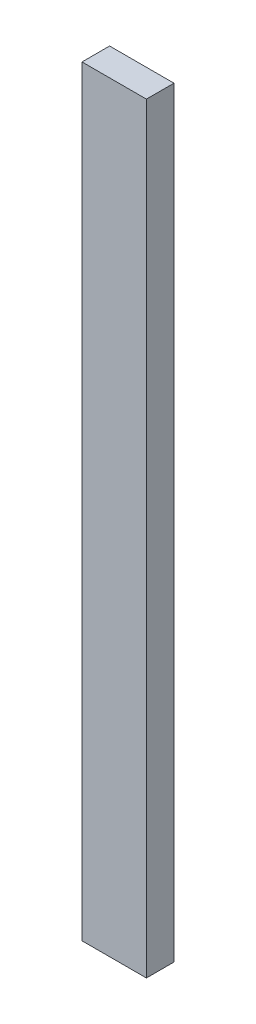
ISO-10303-21;
HEADER;
FILE_DESCRIPTION(('STEP AP214'),'2;1');
FILE_NAME('part.step','',(''),(''),'','','');
FILE_SCHEMA(('AUTOMOTIVE_DESIGN { 1 0 10303 214 1 1 1 1 }'));
ENDSEC;
DATA;
#1=APPLICATION_CONTEXT('core data for automotive mechanical design processes');
#2=APPLICATION_PROTOCOL_DEFINITION('international standard','automotive_design',2000,#1);
#3=PRODUCT_CONTEXT('',#1,'mechanical');
#4=PRODUCT('Part','Part','',(#3));
#5=PRODUCT_RELATED_PRODUCT_CATEGORY('part','',(#4));
#6=PRODUCT_DEFINITION_FORMATION('','',#4);
#7=PRODUCT_DEFINITION_CONTEXT('part definition',#1,'design');
#8=PRODUCT_DEFINITION('design','',#6,#7);
#9=PRODUCT_DEFINITION_SHAPE('','',#8);
#10=(LENGTH_UNIT() NAMED_UNIT(*) SI_UNIT(.MILLI.,.METRE.));
#11=(NAMED_UNIT(*) PLANE_ANGLE_UNIT() SI_UNIT($,.RADIAN.));
#12=(NAMED_UNIT(*) SI_UNIT($,.STERADIAN.) SOLID_ANGLE_UNIT());
#13=UNCERTAINTY_MEASURE_WITH_UNIT(LENGTH_MEASURE(1.E-05),#10,'distance_accuracy_value','');
#14=(GEOMETRIC_REPRESENTATION_CONTEXT(3) GLOBAL_UNCERTAINTY_ASSIGNED_CONTEXT((#13)) GLOBAL_UNIT_ASSIGNED_CONTEXT((#10,
#11,#12)) REPRESENTATION_CONTEXT('',''));
#15=CARTESIAN_POINT('',(0.,0.,0.));
#16=DIRECTION('',(0.,0.,1.));
#17=DIRECTION('',(1.,0.,0.));
#18=AXIS2_PLACEMENT_3D('',#15,#16,#17);
#19=CARTESIAN_POINT('',(-44.45,1050.925,19.05));
#20=DIRECTION('',(-1.,0.,0.));
#21=DIRECTION('',(0.,0.,1.));
#22=AXIS2_PLACEMENT_3D('',#19,#20,#21);
#23=PLANE('',#22);
#24=DIRECTION('',(0.,0.,-1.));
#25=VECTOR('',#24,1.);
#26=CARTESIAN_POINT('',(-44.45,0.,19.05));
#27=LINE('',#26,#25);
#28=CARTESIAN_POINT('',(-44.45,0.,19.05));
#29=VERTEX_POINT('',#28);
#30=CARTESIAN_POINT('',(-44.45,0.,-19.05));
#31=VERTEX_POINT('',#30);
#32=EDGE_CURVE('E104',#29,#31,#27,.T.);
#33=ORIENTED_EDGE('',*,*,#32,.F.);
#34=DIRECTION('',(0.,-1.,0.));
#35=VECTOR('',#34,1.);
#36=CARTESIAN_POINT('',(-44.45,1050.925,19.05));
#37=LINE('',#36,#35);
#38=CARTESIAN_POINT('',(-44.45,1050.925,19.05));
#39=VERTEX_POINT('',#38);
#40=EDGE_CURVE('E11',#39,#29,#37,.T.);
#41=ORIENTED_EDGE('',*,*,#40,.F.);
#42=DIRECTION('',(0.,0.,-1.));
#43=VECTOR('',#42,1.);
#44=CARTESIAN_POINT('',(-44.45,1050.925,19.05));
#45=LINE('',#44,#43);
#46=CARTESIAN_POINT('',(-44.45,1050.925,-19.05));
#47=VERTEX_POINT('',#46);
#48=EDGE_CURVE('E99',#39,#47,#45,.T.);
#49=ORIENTED_EDGE('',*,*,#48,.T.);
#50=DIRECTION('',(0.,-1.,0.));
#51=VECTOR('',#50,1.);
#52=CARTESIAN_POINT('',(-44.45,1050.925,-19.05));
#53=LINE('',#52,#51);
#54=EDGE_CURVE('E42',#47,#31,#53,.T.);
#55=ORIENTED_EDGE('',*,*,#54,.T.);
#56=EDGE_LOOP('',(#33,#41,#49,#55));
#57=FACE_BOUND('',#56,.T.);
#58=ADVANCED_FACE('F39',(#57),#23,.T.);
#59=CARTESIAN_POINT('',(-44.45,1050.925,19.05));
#60=DIRECTION('',(0.,0.,-1.));
#61=DIRECTION('',(-1.,0.,0.));
#62=AXIS2_PLACEMENT_3D('',#59,#60,#61);
#63=PLANE('',#62);
#64=DIRECTION('',(1.,0.,0.));
#65=VECTOR('',#64,1.);
#66=CARTESIAN_POINT('',(-44.45,0.,19.05));
#67=LINE('',#66,#65);
#68=CARTESIAN_POINT('',(44.45,0.,19.05));
#69=VERTEX_POINT('',#68);
#70=EDGE_CURVE('E72',#29,#69,#67,.T.);
#71=ORIENTED_EDGE('',*,*,#70,.T.);
#72=DIRECTION('',(0.,-1.,0.));
#73=VECTOR('',#72,1.);
#74=CARTESIAN_POINT('',(44.45,1050.925,19.05));
#75=LINE('',#74,#73);
#76=CARTESIAN_POINT('',(44.45,1050.925,19.05));
#77=VERTEX_POINT('',#76);
#78=EDGE_CURVE('E48',#77,#69,#75,.T.);
#79=ORIENTED_EDGE('',*,*,#78,.F.);
#80=DIRECTION('',(1.,0.,0.));
#81=VECTOR('',#80,1.);
#82=CARTESIAN_POINT('',(-44.45,1050.925,19.05));
#83=LINE('',#82,#81);
#84=EDGE_CURVE('E89',#39,#77,#83,.T.);
#85=ORIENTED_EDGE('',*,*,#84,.F.);
#86=ORIENTED_EDGE('',*,*,#40,.T.);
#87=EDGE_LOOP('',(#71,#79,#85,#86));
#88=FACE_BOUND('',#87,.T.);
#89=ADVANCED_FACE('F114',(#88),#63,.F.);
#90=CARTESIAN_POINT('',(44.45,1050.925,19.05));
#91=DIRECTION('',(-1.,0.,0.));
#92=DIRECTION('',(0.,0.,1.));
#93=AXIS2_PLACEMENT_3D('',#90,#91,#92);
#94=PLANE('',#93);
#95=DIRECTION('',(0.,0.,-1.));
#96=VECTOR('',#95,1.);
#97=CARTESIAN_POINT('',(44.45,0.,19.05));
#98=LINE('',#97,#96);
#99=CARTESIAN_POINT('',(44.45,0.,-19.05));
#100=VERTEX_POINT('',#99);
#101=EDGE_CURVE('E96',#69,#100,#98,.T.);
#102=ORIENTED_EDGE('',*,*,#101,.T.);
#103=DIRECTION('',(0.,-1.,0.));
#104=VECTOR('',#103,1.);
#105=CARTESIAN_POINT('',(44.45,1050.925,-19.05));
#106=LINE('',#105,#104);
#107=CARTESIAN_POINT('',(44.45,1050.925,-19.05));
#108=VERTEX_POINT('',#107);
#109=EDGE_CURVE('E93',#108,#100,#106,.T.);
#110=ORIENTED_EDGE('',*,*,#109,.F.);
#111=DIRECTION('',(0.,0.,-1.));
#112=VECTOR('',#111,1.);
#113=CARTESIAN_POINT('',(44.45,1050.925,19.05));
#114=LINE('',#113,#112);
#115=EDGE_CURVE('E84',#77,#108,#114,.T.);
#116=ORIENTED_EDGE('',*,*,#115,.F.);
#117=ORIENTED_EDGE('',*,*,#78,.T.);
#118=EDGE_LOOP('',(#102,#110,#116,#117));
#119=FACE_BOUND('',#118,.T.);
#120=ADVANCED_FACE('F94',(#119),#94,.F.);
#121=CARTESIAN_POINT('',(-44.45,1050.925,-19.05));
#122=DIRECTION('',(0.,0.,-1.));
#123=DIRECTION('',(-1.,0.,0.));
#124=AXIS2_PLACEMENT_3D('',#121,#122,#123);
#125=PLANE('',#124);
#126=DIRECTION('',(1.,0.,0.));
#127=VECTOR('',#126,1.);
#128=CARTESIAN_POINT('',(-44.45,0.,-19.05));
#129=LINE('',#128,#127);
#130=EDGE_CURVE('E107',#31,#100,#129,.T.);
#131=ORIENTED_EDGE('',*,*,#130,.F.);
#132=ORIENTED_EDGE('',*,*,#54,.F.);
#133=DIRECTION('',(1.,0.,0.));
#134=VECTOR('',#133,1.);
#135=CARTESIAN_POINT('',(-44.45,1050.925,-19.05));
#136=LINE('',#135,#134);
#137=EDGE_CURVE('E88',#47,#108,#136,.T.);
#138=ORIENTED_EDGE('',*,*,#137,.T.);
#139=ORIENTED_EDGE('',*,*,#109,.T.);
#140=EDGE_LOOP('',(#131,#132,#138,#139));
#141=FACE_BOUND('',#140,.T.);
#142=ADVANCED_FACE('F98',(#141),#125,.T.);
#143=CARTESIAN_POINT('',(0.,1050.925,0.));
#144=DIRECTION('',(0.,-1.,0.));
#145=DIRECTION('',(0.,0.,-1.));
#146=AXIS2_PLACEMENT_3D('',#143,#144,#145);
#147=PLANE('',#146);
#148=ORIENTED_EDGE('',*,*,#48,.F.);
#149=ORIENTED_EDGE('',*,*,#84,.T.);
#150=ORIENTED_EDGE('',*,*,#115,.T.);
#151=ORIENTED_EDGE('',*,*,#137,.F.);
#152=EDGE_LOOP('',(#148,#149,#150,#151));
#153=FACE_BOUND('',#152,.T.);
#154=ADVANCED_FACE('F87',(#153),#147,.F.);
#155=CARTESIAN_POINT('',(0.,0.,0.));
#156=DIRECTION('',(0.,-1.,0.));
#157=DIRECTION('',(0.,0.,-1.));
#158=AXIS2_PLACEMENT_3D('',#155,#156,#157);
#159=PLANE('',#158);
#160=ORIENTED_EDGE('',*,*,#32,.T.);
#161=ORIENTED_EDGE('',*,*,#130,.T.);
#162=ORIENTED_EDGE('',*,*,#101,.F.);
#163=ORIENTED_EDGE('',*,*,#70,.F.);
#164=EDGE_LOOP('',(#160,#161,#162,#163));
#165=FACE_BOUND('',#164,.T.);
#166=ADVANCED_FACE('F112',(#165),#159,.T.);
#167=CLOSED_SHELL('',(#58,#89,#120,#142,#154,#166));
#168=MANIFOLD_SOLID_BREP('B2',#167);
#169=ADVANCED_BREP_SHAPE_REPRESENTATION('',(#18,#168),#14);
#170=SHAPE_DEFINITION_REPRESENTATION(#9,#169);
ENDSEC;
END-ISO-10303-21;
